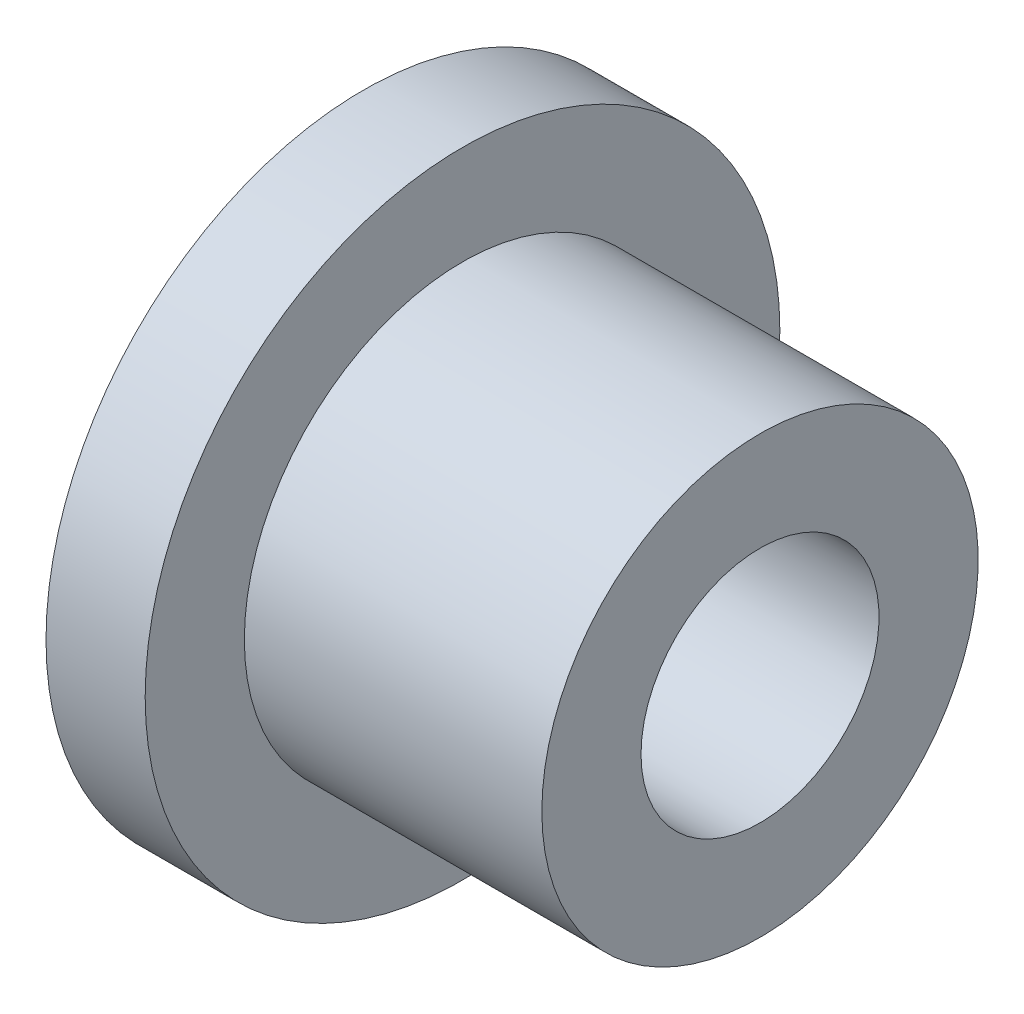
ISO-10303-21;
HEADER;
FILE_DESCRIPTION(('STEP AP214'),'2;1');
FILE_NAME('part.step','',(''),(''),'','','');
FILE_SCHEMA(('AUTOMOTIVE_DESIGN { 1 0 10303 214 1 1 1 1 }'));
ENDSEC;
DATA;
#1=APPLICATION_CONTEXT('core data for automotive mechanical design processes');
#2=APPLICATION_PROTOCOL_DEFINITION('international standard','automotive_design',2000,#1);
#3=PRODUCT_CONTEXT('',#1,'mechanical');
#4=PRODUCT('Part','Part','',(#3));
#5=PRODUCT_RELATED_PRODUCT_CATEGORY('part','',(#4));
#6=PRODUCT_DEFINITION_FORMATION('','',#4);
#7=PRODUCT_DEFINITION_CONTEXT('part definition',#1,'design');
#8=PRODUCT_DEFINITION('design','',#6,#7);
#9=PRODUCT_DEFINITION_SHAPE('','',#8);
#10=(LENGTH_UNIT() NAMED_UNIT(*) SI_UNIT(.MILLI.,.METRE.));
#11=(NAMED_UNIT(*) PLANE_ANGLE_UNIT() SI_UNIT($,.RADIAN.));
#12=(NAMED_UNIT(*) SI_UNIT($,.STERADIAN.) SOLID_ANGLE_UNIT());
#13=UNCERTAINTY_MEASURE_WITH_UNIT(LENGTH_MEASURE(1.E-05),#10,'distance_accuracy_value','');
#14=(GEOMETRIC_REPRESENTATION_CONTEXT(3) GLOBAL_UNCERTAINTY_ASSIGNED_CONTEXT((#13)) GLOBAL_UNIT_ASSIGNED_CONTEXT((#10,
#11,#12)) REPRESENTATION_CONTEXT('',''));
#15=CARTESIAN_POINT('',(0.,0.,0.));
#16=DIRECTION('',(0.,0.,1.));
#17=DIRECTION('',(1.,0.,0.));
#18=AXIS2_PLACEMENT_3D('',#15,#16,#17);
#19=CARTESIAN_POINT('',(-20.,0.,0.));
#20=DIRECTION('',(-1.,0.,0.));
#21=DIRECTION('',(0.,0.,1.));
#22=AXIS2_PLACEMENT_3D('',#19,#20,#21);
#23=CYLINDRICAL_SURFACE('',#22,6.);
#24=CARTESIAN_POINT('',(20.,0.,0.));
#25=DIRECTION('',(-1.,0.,0.));
#26=DIRECTION('',(0.,0.,1.));
#27=AXIS2_PLACEMENT_3D('',#24,#25,#26);
#28=CIRCLE('',#27,6.);
#29=CARTESIAN_POINT('',(20.,0.,6.));
#30=VERTEX_POINT('',#29);
#31=EDGE_CURVE('E63',#30,#30,#28,.T.);
#32=ORIENTED_EDGE('',*,*,#31,.F.);
#33=EDGE_LOOP('',(#32));
#34=FACE_BOUND('',#33,.T.);
#35=CARTESIAN_POINT('',(0.,0.,0.));
#36=DIRECTION('',(-1.,0.,0.));
#37=DIRECTION('',(0.,0.,1.));
#38=AXIS2_PLACEMENT_3D('',#35,#36,#37);
#39=CIRCLE('',#38,6.);
#40=CARTESIAN_POINT('',(0.,0.,6.));
#41=VERTEX_POINT('',#40);
#42=EDGE_CURVE('E10',#41,#41,#39,.T.);
#43=ORIENTED_EDGE('',*,*,#42,.T.);
#44=EDGE_LOOP('',(#43));
#45=FACE_BOUND('',#44,.T.);
#46=ADVANCED_FACE('F41',(#34,#45),#23,.F.);
#47=CARTESIAN_POINT('',(0.,6.,0.));
#48=DIRECTION('',(1.,0.,0.));
#49=DIRECTION('',(0.,0.,-1.));
#50=AXIS2_PLACEMENT_3D('',#47,#48,#49);
#51=PLANE('',#50);
#52=ORIENTED_EDGE('',*,*,#42,.F.);
#53=EDGE_LOOP('',(#52));
#54=FACE_BOUND('',#53,.T.);
#55=CARTESIAN_POINT('',(0.,0.,0.));
#56=DIRECTION('',(-1.,0.,0.));
#57=DIRECTION('',(0.,0.,1.));
#58=AXIS2_PLACEMENT_3D('',#55,#56,#57);
#59=CIRCLE('',#58,16.);
#60=CARTESIAN_POINT('',(0.,0.,16.));
#61=VERTEX_POINT('',#60);
#62=EDGE_CURVE('E47',#61,#61,#59,.T.);
#63=ORIENTED_EDGE('',*,*,#62,.T.);
#64=EDGE_LOOP('',(#63));
#65=FACE_BOUND('',#64,.T.);
#66=ADVANCED_FACE('F70',(#54,#65),#51,.F.);
#67=CARTESIAN_POINT('',(-20.,0.,0.));
#68=DIRECTION('',(-1.,0.,0.));
#69=DIRECTION('',(0.,0.,1.));
#70=AXIS2_PLACEMENT_3D('',#67,#68,#69);
#71=CYLINDRICAL_SURFACE('',#70,16.);
#72=ORIENTED_EDGE('',*,*,#62,.F.);
#73=EDGE_LOOP('',(#72));
#74=FACE_BOUND('',#73,.T.);
#75=CARTESIAN_POINT('',(5.,0.,0.));
#76=DIRECTION('',(-1.,0.,0.));
#77=DIRECTION('',(0.,0.,1.));
#78=AXIS2_PLACEMENT_3D('',#75,#76,#77);
#79=CIRCLE('',#78,16.);
#80=CARTESIAN_POINT('',(5.,0.,16.));
#81=VERTEX_POINT('',#80);
#82=EDGE_CURVE('E51',#81,#81,#79,.T.);
#83=ORIENTED_EDGE('',*,*,#82,.T.);
#84=EDGE_LOOP('',(#83));
#85=FACE_BOUND('',#84,.T.);
#86=ADVANCED_FACE('F74',(#74,#85),#71,.T.);
#87=CARTESIAN_POINT('',(5.,16.,0.));
#88=DIRECTION('',(-1.,0.,0.));
#89=DIRECTION('',(0.,0.,1.));
#90=AXIS2_PLACEMENT_3D('',#87,#88,#89);
#91=PLANE('',#90);
#92=ORIENTED_EDGE('',*,*,#82,.F.);
#93=EDGE_LOOP('',(#92));
#94=FACE_BOUND('',#93,.T.);
#95=CARTESIAN_POINT('',(5.,0.,0.));
#96=DIRECTION('',(-1.,0.,0.));
#97=DIRECTION('',(0.,0.,1.));
#98=AXIS2_PLACEMENT_3D('',#95,#96,#97);
#99=CIRCLE('',#98,11.);
#100=CARTESIAN_POINT('',(5.,0.,11.));
#101=VERTEX_POINT('',#100);
#102=EDGE_CURVE('E55',#101,#101,#99,.T.);
#103=ORIENTED_EDGE('',*,*,#102,.T.);
#104=EDGE_LOOP('',(#103));
#105=FACE_BOUND('',#104,.T.);
#106=ADVANCED_FACE('F79',(#94,#105),#91,.F.);
#107=CARTESIAN_POINT('',(-20.,0.,0.));
#108=DIRECTION('',(-1.,0.,0.));
#109=DIRECTION('',(0.,0.,1.));
#110=AXIS2_PLACEMENT_3D('',#107,#108,#109);
#111=CYLINDRICAL_SURFACE('',#110,11.);
#112=ORIENTED_EDGE('',*,*,#102,.F.);
#113=EDGE_LOOP('',(#112));
#114=FACE_BOUND('',#113,.T.);
#115=CARTESIAN_POINT('',(20.,0.,0.));
#116=DIRECTION('',(-1.,0.,0.));
#117=DIRECTION('',(0.,0.,1.));
#118=AXIS2_PLACEMENT_3D('',#115,#116,#117);
#119=CIRCLE('',#118,11.);
#120=CARTESIAN_POINT('',(20.,0.,11.));
#121=VERTEX_POINT('',#120);
#122=EDGE_CURVE('E60',#121,#121,#119,.T.);
#123=ORIENTED_EDGE('',*,*,#122,.T.);
#124=EDGE_LOOP('',(#123));
#125=FACE_BOUND('',#124,.T.);
#126=ADVANCED_FACE('F85',(#114,#125),#111,.T.);
#127=CARTESIAN_POINT('',(20.,11.,0.));
#128=DIRECTION('',(-1.,0.,0.));
#129=DIRECTION('',(0.,0.,1.));
#130=AXIS2_PLACEMENT_3D('',#127,#128,#129);
#131=PLANE('',#130);
#132=ORIENTED_EDGE('',*,*,#122,.F.);
#133=EDGE_LOOP('',(#132));
#134=FACE_BOUND('',#133,.T.);
#135=ORIENTED_EDGE('',*,*,#31,.T.);
#136=EDGE_LOOP('',(#135));
#137=FACE_BOUND('',#136,.T.);
#138=ADVANCED_FACE('F67',(#134,#137),#131,.F.);
#139=CLOSED_SHELL('',(#46,#66,#86,#106,#126,#138));
#140=MANIFOLD_SOLID_BREP('B2',#139);
#141=ADVANCED_BREP_SHAPE_REPRESENTATION('',(#18,#140),#14);
#142=SHAPE_DEFINITION_REPRESENTATION(#9,#141);
ENDSEC;
END-ISO-10303-21;
